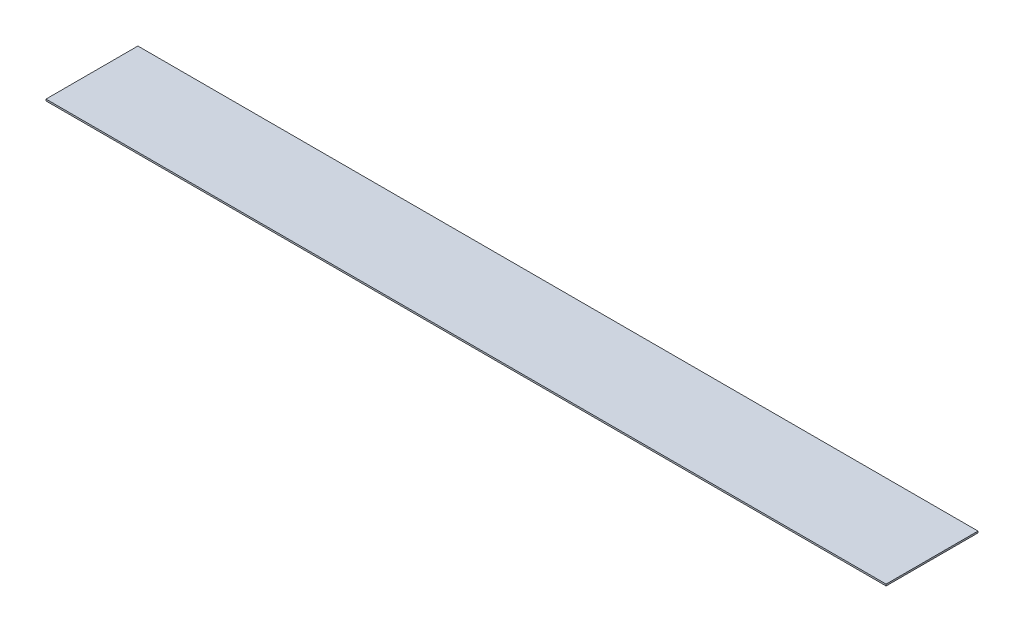
ISO-10303-21;
HEADER;
FILE_DESCRIPTION(('STEP AP214'),'2;1');
FILE_NAME('part.step','',(''),(''),'','','');
FILE_SCHEMA(('AUTOMOTIVE_DESIGN { 1 0 10303 214 1 1 1 1 }'));
ENDSEC;
DATA;
#1=APPLICATION_CONTEXT('core data for automotive mechanical design processes');
#2=APPLICATION_PROTOCOL_DEFINITION('international standard','automotive_design',2000,#1);
#3=PRODUCT_CONTEXT('',#1,'mechanical');
#4=PRODUCT('Part','Part','',(#3));
#5=PRODUCT_RELATED_PRODUCT_CATEGORY('part','',(#4));
#6=PRODUCT_DEFINITION_FORMATION('','',#4);
#7=PRODUCT_DEFINITION_CONTEXT('part definition',#1,'design');
#8=PRODUCT_DEFINITION('design','',#6,#7);
#9=PRODUCT_DEFINITION_SHAPE('','',#8);
#10=(LENGTH_UNIT() NAMED_UNIT(*) SI_UNIT(.MILLI.,.METRE.));
#11=(NAMED_UNIT(*) PLANE_ANGLE_UNIT() SI_UNIT($,.RADIAN.));
#12=(NAMED_UNIT(*) SI_UNIT($,.STERADIAN.) SOLID_ANGLE_UNIT());
#13=UNCERTAINTY_MEASURE_WITH_UNIT(LENGTH_MEASURE(1.E-05),#10,'distance_accuracy_value','');
#14=(GEOMETRIC_REPRESENTATION_CONTEXT(3) GLOBAL_UNCERTAINTY_ASSIGNED_CONTEXT((#13)) GLOBAL_UNIT_ASSIGNED_CONTEXT((#10,
#11,#12)) REPRESENTATION_CONTEXT('',''));
#15=CARTESIAN_POINT('',(0.,0.,0.));
#16=DIRECTION('',(0.,0.,1.));
#17=DIRECTION('',(1.,0.,0.));
#18=AXIS2_PLACEMENT_3D('',#15,#16,#17);
#19=CARTESIAN_POINT('',(-203.2,-0.79375,22.225));
#20=DIRECTION('',(0.,-1.,0.));
#21=DIRECTION('',(0.,0.,-1.));
#22=AXIS2_PLACEMENT_3D('',#19,#20,#21);
#23=PLANE('',#22);
#24=DIRECTION('',(1.,0.,0.));
#25=VECTOR('',#24,1.);
#26=CARTESIAN_POINT('',(-203.2,-0.79375,22.225));
#27=LINE('',#26,#25);
#28=CARTESIAN_POINT('',(-203.2,-0.79375,22.225));
#29=VERTEX_POINT('',#28);
#30=CARTESIAN_POINT('',(203.2,-0.79375,22.225));
#31=VERTEX_POINT('',#30);
#32=EDGE_CURVE('E20',#29,#31,#27,.T.);
#33=ORIENTED_EDGE('',*,*,#32,.F.);
#34=DIRECTION('',(0.,0.,-1.));
#35=VECTOR('',#34,1.);
#36=CARTESIAN_POINT('',(-203.2,-0.79375,0.));
#37=LINE('',#36,#35);
#38=CARTESIAN_POINT('',(-203.2,-0.79375,-22.225));
#39=VERTEX_POINT('',#38);
#40=EDGE_CURVE('E80',#29,#39,#37,.T.);
#41=ORIENTED_EDGE('',*,*,#40,.T.);
#42=DIRECTION('',(-1.,0.,0.));
#43=VECTOR('',#42,1.);
#44=CARTESIAN_POINT('',(-203.2,-0.79375,-22.225));
#45=LINE('',#44,#43);
#46=CARTESIAN_POINT('',(203.2,-0.79375,-22.225));
#47=VERTEX_POINT('',#46);
#48=EDGE_CURVE('E68',#47,#39,#45,.T.);
#49=ORIENTED_EDGE('',*,*,#48,.F.);
#50=DIRECTION('',(0.,0.,-1.));
#51=VECTOR('',#50,1.);
#52=CARTESIAN_POINT('',(203.2,-0.79375,0.));
#53=LINE('',#52,#51);
#54=EDGE_CURVE('E56',#31,#47,#53,.T.);
#55=ORIENTED_EDGE('',*,*,#54,.F.);
#56=EDGE_LOOP('',(#33,#41,#49,#55));
#57=FACE_BOUND('',#56,.T.);
#58=ADVANCED_FACE('F17',(#57),#23,.T.);
#59=CARTESIAN_POINT('',(-203.2,0.,22.225));
#60=DIRECTION('',(0.,0.,1.));
#61=DIRECTION('',(1.,0.,0.));
#62=AXIS2_PLACEMENT_3D('',#59,#60,#61);
#63=PLANE('',#62);
#64=DIRECTION('',(1.,0.,0.));
#65=VECTOR('',#64,1.);
#66=CARTESIAN_POINT('',(-203.2,0.,22.225));
#67=LINE('',#66,#65);
#68=CARTESIAN_POINT('',(-203.2,0.,22.225));
#69=VERTEX_POINT('',#68);
#70=CARTESIAN_POINT('',(203.2,0.,22.225));
#71=VERTEX_POINT('',#70);
#72=EDGE_CURVE('E83',#69,#71,#67,.T.);
#73=ORIENTED_EDGE('',*,*,#72,.F.);
#74=DIRECTION('',(0.,1.,0.));
#75=VECTOR('',#74,1.);
#76=CARTESIAN_POINT('',(-203.2,0.,22.225));
#77=LINE('',#76,#75);
#78=EDGE_CURVE('E65',#69,#29,#77,.F.);
#79=ORIENTED_EDGE('',*,*,#78,.T.);
#80=ORIENTED_EDGE('',*,*,#32,.T.);
#81=DIRECTION('',(0.,1.,0.));
#82=VECTOR('',#81,1.);
#83=CARTESIAN_POINT('',(203.2,0.,22.225));
#84=LINE('',#83,#82);
#85=EDGE_CURVE('E62',#71,#31,#84,.F.);
#86=ORIENTED_EDGE('',*,*,#85,.F.);
#87=EDGE_LOOP('',(#73,#79,#80,#86));
#88=FACE_BOUND('',#87,.T.);
#89=ADVANCED_FACE('F61',(#88),#63,.T.);
#90=CARTESIAN_POINT('',(203.2,0.,0.));
#91=DIRECTION('',(1.,0.,0.));
#92=DIRECTION('',(0.,0.,-1.));
#93=AXIS2_PLACEMENT_3D('',#90,#91,#92);
#94=PLANE('',#93);
#95=DIRECTION('',(0.,1.,0.));
#96=VECTOR('',#95,1.);
#97=CARTESIAN_POINT('',(203.2,-0.79375,-22.225));
#98=LINE('',#97,#96);
#99=CARTESIAN_POINT('',(203.2,0.,-22.225));
#100=VERTEX_POINT('',#99);
#101=EDGE_CURVE('E70',#100,#47,#98,.F.);
#102=ORIENTED_EDGE('',*,*,#101,.F.);
#103=DIRECTION('',(0.,0.,1.));
#104=VECTOR('',#103,1.);
#105=CARTESIAN_POINT('',(203.2,0.,-22.225));
#106=LINE('',#105,#104);
#107=EDGE_CURVE('E74',#71,#100,#106,.F.);
#108=ORIENTED_EDGE('',*,*,#107,.F.);
#109=ORIENTED_EDGE('',*,*,#85,.T.);
#110=ORIENTED_EDGE('',*,*,#54,.T.);
#111=EDGE_LOOP('',(#102,#108,#109,#110));
#112=FACE_BOUND('',#111,.T.);
#113=ADVANCED_FACE('F72',(#112),#94,.T.);
#114=CARTESIAN_POINT('',(-203.2,-0.79375,-22.225));
#115=DIRECTION('',(0.,0.,-1.));
#116=DIRECTION('',(-1.,0.,0.));
#117=AXIS2_PLACEMENT_3D('',#114,#115,#116);
#118=PLANE('',#117);
#119=ORIENTED_EDGE('',*,*,#48,.T.);
#120=DIRECTION('',(0.,1.,0.));
#121=VECTOR('',#120,1.);
#122=CARTESIAN_POINT('',(-203.2,0.,-22.225));
#123=LINE('',#122,#121);
#124=CARTESIAN_POINT('',(-203.2,0.,-22.225));
#125=VERTEX_POINT('',#124);
#126=EDGE_CURVE('E35',#39,#125,#123,.T.);
#127=ORIENTED_EDGE('',*,*,#126,.T.);
#128=DIRECTION('',(1.,0.,0.));
#129=VECTOR('',#128,1.);
#130=CARTESIAN_POINT('',(-203.2,0.,-22.225));
#131=LINE('',#130,#129);
#132=EDGE_CURVE('E26',#100,#125,#131,.F.);
#133=ORIENTED_EDGE('',*,*,#132,.F.);
#134=ORIENTED_EDGE('',*,*,#101,.T.);
#135=EDGE_LOOP('',(#119,#127,#133,#134));
#136=FACE_BOUND('',#135,.T.);
#137=ADVANCED_FACE('F89',(#136),#118,.T.);
#138=CARTESIAN_POINT('',(-203.2,0.,0.));
#139=DIRECTION('',(1.,0.,0.));
#140=DIRECTION('',(0.,0.,-1.));
#141=AXIS2_PLACEMENT_3D('',#138,#139,#140);
#142=PLANE('',#141);
#143=ORIENTED_EDGE('',*,*,#40,.F.);
#144=ORIENTED_EDGE('',*,*,#78,.F.);
#145=DIRECTION('',(0.,0.,1.));
#146=VECTOR('',#145,1.);
#147=CARTESIAN_POINT('',(-203.2,0.,-22.225));
#148=LINE('',#147,#146);
#149=EDGE_CURVE('E11',#125,#69,#148,.T.);
#150=ORIENTED_EDGE('',*,*,#149,.F.);
#151=ORIENTED_EDGE('',*,*,#126,.F.);
#152=EDGE_LOOP('',(#143,#144,#150,#151));
#153=FACE_BOUND('',#152,.T.);
#154=ADVANCED_FACE('F91',(#153),#142,.F.);
#155=CARTESIAN_POINT('',(-203.2,0.,-22.225));
#156=DIRECTION('',(0.,1.,0.));
#157=DIRECTION('',(0.,0.,1.));
#158=AXIS2_PLACEMENT_3D('',#155,#156,#157);
#159=PLANE('',#158);
#160=ORIENTED_EDGE('',*,*,#132,.T.);
#161=ORIENTED_EDGE('',*,*,#149,.T.);
#162=ORIENTED_EDGE('',*,*,#72,.T.);
#163=ORIENTED_EDGE('',*,*,#107,.T.);
#164=EDGE_LOOP('',(#160,#161,#162,#163));
#165=FACE_BOUND('',#164,.T.);
#166=ADVANCED_FACE('F88',(#165),#159,.T.);
#167=CLOSED_SHELL('',(#58,#89,#113,#137,#154,#166));
#168=MANIFOLD_SOLID_BREP('B1',#167);
#169=ADVANCED_BREP_SHAPE_REPRESENTATION('',(#18,#168),#14);
#170=SHAPE_DEFINITION_REPRESENTATION(#9,#169);
ENDSEC;
END-ISO-10303-21;
